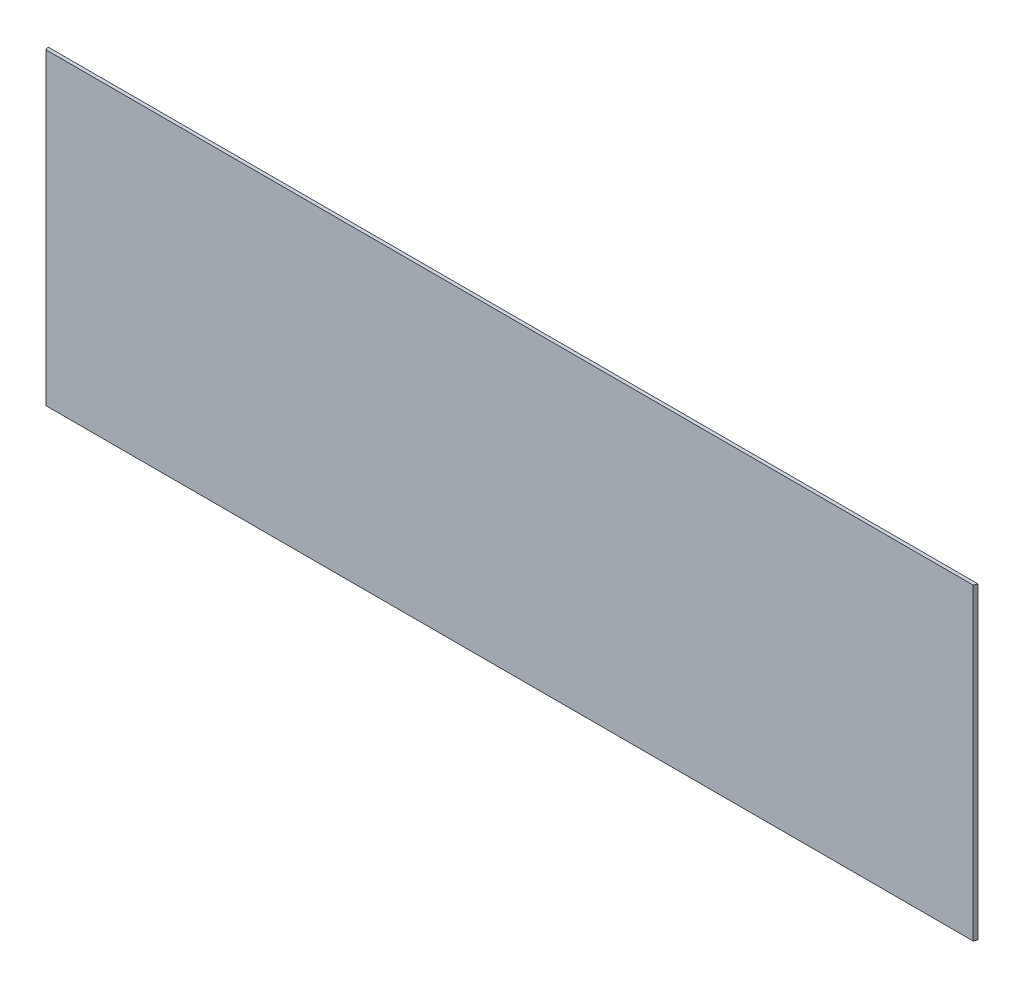
ISO-10303-21;
HEADER;
FILE_DESCRIPTION(('STEP AP214'),'2;1');
FILE_NAME('part.step','',(''),(''),'','','');
FILE_SCHEMA(('AUTOMOTIVE_DESIGN { 1 0 10303 214 1 1 1 1 }'));
ENDSEC;
DATA;
#1=APPLICATION_CONTEXT('core data for automotive mechanical design processes');
#2=APPLICATION_PROTOCOL_DEFINITION('international standard','automotive_design',2000,#1);
#3=PRODUCT_CONTEXT('',#1,'mechanical');
#4=PRODUCT('Part','Part','',(#3));
#5=PRODUCT_RELATED_PRODUCT_CATEGORY('part','',(#4));
#6=PRODUCT_DEFINITION_FORMATION('','',#4);
#7=PRODUCT_DEFINITION_CONTEXT('part definition',#1,'design');
#8=PRODUCT_DEFINITION('design','',#6,#7);
#9=PRODUCT_DEFINITION_SHAPE('','',#8);
#10=(LENGTH_UNIT() NAMED_UNIT(*) SI_UNIT(.MILLI.,.METRE.));
#11=(NAMED_UNIT(*) PLANE_ANGLE_UNIT() SI_UNIT($,.RADIAN.));
#12=(NAMED_UNIT(*) SI_UNIT($,.STERADIAN.) SOLID_ANGLE_UNIT());
#13=UNCERTAINTY_MEASURE_WITH_UNIT(LENGTH_MEASURE(1.E-05),#10,'distance_accuracy_value','');
#14=(GEOMETRIC_REPRESENTATION_CONTEXT(3) GLOBAL_UNCERTAINTY_ASSIGNED_CONTEXT((#13)) GLOBAL_UNIT_ASSIGNED_CONTEXT((#10,
#11,#12)) REPRESENTATION_CONTEXT('',''));
#15=CARTESIAN_POINT('',(0.,0.,0.));
#16=DIRECTION('',(0.,0.,1.));
#17=DIRECTION('',(1.,0.,0.));
#18=AXIS2_PLACEMENT_3D('',#15,#16,#17);
#19=CARTESIAN_POINT('',(-431.038,142.875,-1.58750000000003));
#20=DIRECTION('',(0.923879532511753,0.,-0.382683432363964));
#21=DIRECTION('',(-0.382683432363964,0.,-0.923879532511753));
#22=AXIS2_PLACEMENT_3D('',#19,#20,#21);
#23=PLANE('',#22);
#24=DIRECTION('',(0.382683432363964,0.,0.923879532511753));
#25=VECTOR('',#24,1.);
#26=CARTESIAN_POINT('',(-431.038,-142.875,-1.58750000000003));
#27=LINE('',#26,#25);
#28=CARTESIAN_POINT('',(-431.038,-142.875,-1.58750000000003));
#29=VERTEX_POINT('',#28);
#30=CARTESIAN_POINT('',(-429.72287193947,-142.875,1.58749999999992));
#31=VERTEX_POINT('',#30);
#32=EDGE_CURVE('E95',#29,#31,#27,.T.);
#33=ORIENTED_EDGE('',*,*,#32,.T.);
#34=DIRECTION('',(0.,-1.,0.));
#35=VECTOR('',#34,1.);
#36=CARTESIAN_POINT('',(-429.72287193947,142.875,1.58749999999992));
#37=LINE('',#36,#35);
#38=CARTESIAN_POINT('',(-429.72287193947,142.875,1.58749999999992));
#39=VERTEX_POINT('',#38);
#40=EDGE_CURVE('E11',#39,#31,#37,.T.);
#41=ORIENTED_EDGE('',*,*,#40,.F.);
#42=DIRECTION('',(0.382683432363964,0.,0.923879532511753));
#43=VECTOR('',#42,1.);
#44=CARTESIAN_POINT('',(-431.038,142.875,-1.58750000000003));
#45=LINE('',#44,#43);
#46=CARTESIAN_POINT('',(-431.038,142.875,-1.58750000000003));
#47=VERTEX_POINT('',#46);
#48=EDGE_CURVE('E83',#47,#39,#45,.T.);
#49=ORIENTED_EDGE('',*,*,#48,.F.);
#50=DIRECTION('',(0.,-1.,0.));
#51=VECTOR('',#50,1.);
#52=CARTESIAN_POINT('',(-431.038,142.875,-1.58750000000003));
#53=LINE('',#52,#51);
#54=EDGE_CURVE('E91',#47,#29,#53,.T.);
#55=ORIENTED_EDGE('',*,*,#54,.T.);
#56=EDGE_LOOP('',(#33,#41,#49,#55));
#57=FACE_BOUND('',#56,.T.);
#58=ADVANCED_FACE('F32',(#57),#23,.F.);
#59=CARTESIAN_POINT('',(-429.72287193947,142.875,1.58749999999992));
#60=DIRECTION('',(0.,0.,-1.));
#61=DIRECTION('',(-1.,0.,0.));
#62=AXIS2_PLACEMENT_3D('',#59,#60,#61);
#63=PLANE('',#62);
#64=DIRECTION('',(1.,0.,0.));
#65=VECTOR('',#64,1.);
#66=CARTESIAN_POINT('',(-429.72287193947,-142.875,1.58749999999992));
#67=LINE('',#66,#65);
#68=CARTESIAN_POINT('',(429.722871939465,-142.875,1.58749999999992));
#69=VERTEX_POINT('',#68);
#70=EDGE_CURVE('E87',#31,#69,#67,.T.);
#71=ORIENTED_EDGE('',*,*,#70,.T.);
#72=DIRECTION('',(0.,-1.,0.));
#73=VECTOR('',#72,1.);
#74=CARTESIAN_POINT('',(429.722871939465,142.875,1.58749999999992));
#75=LINE('',#74,#73);
#76=CARTESIAN_POINT('',(429.722871939465,142.875,1.58749999999992));
#77=VERTEX_POINT('',#76);
#78=EDGE_CURVE('E40',#77,#69,#75,.T.);
#79=ORIENTED_EDGE('',*,*,#78,.F.);
#80=DIRECTION('',(1.,0.,0.));
#81=VECTOR('',#80,1.);
#82=CARTESIAN_POINT('',(-429.72287193947,142.875,1.58749999999992));
#83=LINE('',#82,#81);
#84=EDGE_CURVE('E78',#39,#77,#83,.T.);
#85=ORIENTED_EDGE('',*,*,#84,.F.);
#86=ORIENTED_EDGE('',*,*,#40,.T.);
#87=EDGE_LOOP('',(#71,#79,#85,#86));
#88=FACE_BOUND('',#87,.T.);
#89=ADVANCED_FACE('F86',(#88),#63,.F.);
#90=CARTESIAN_POINT('',(431.038,142.875,-1.58750000000003));
#91=DIRECTION('',(-0.923879532511285,0.,-0.382683432365095));
#92=DIRECTION('',(-0.382683432365095,0.,0.923879532511285));
#93=AXIS2_PLACEMENT_3D('',#90,#91,#92);
#94=PLANE('',#93);
#95=DIRECTION('',(0.382683432365095,0.,-0.923879532511285));
#96=VECTOR('',#95,1.);
#97=CARTESIAN_POINT('',(431.038,-142.875,-1.58750000000003));
#98=LINE('',#97,#96);
#99=CARTESIAN_POINT('',(431.038,-142.875,-1.58750000000003));
#100=VERTEX_POINT('',#99);
#101=EDGE_CURVE('E65',#69,#100,#98,.T.);
#102=ORIENTED_EDGE('',*,*,#101,.T.);
#103=DIRECTION('',(0.,-1.,0.));
#104=VECTOR('',#103,1.);
#105=CARTESIAN_POINT('',(431.038,142.875,-1.58750000000003));
#106=LINE('',#105,#104);
#107=CARTESIAN_POINT('',(431.038,142.875,-1.58750000000003));
#108=VERTEX_POINT('',#107);
#109=EDGE_CURVE('E88',#108,#100,#106,.T.);
#110=ORIENTED_EDGE('',*,*,#109,.F.);
#111=DIRECTION('',(0.382683432365095,0.,-0.923879532511285));
#112=VECTOR('',#111,1.);
#113=CARTESIAN_POINT('',(431.038,142.875,-1.58750000000003));
#114=LINE('',#113,#112);
#115=EDGE_CURVE('E81',#77,#108,#114,.T.);
#116=ORIENTED_EDGE('',*,*,#115,.F.);
#117=ORIENTED_EDGE('',*,*,#78,.T.);
#118=EDGE_LOOP('',(#102,#110,#116,#117));
#119=FACE_BOUND('',#118,.T.);
#120=ADVANCED_FACE('F89',(#119),#94,.F.);
#121=CARTESIAN_POINT('',(-431.038,142.875,-1.58750000000003));
#122=DIRECTION('',(0.,0.,1.));
#123=DIRECTION('',(1.,0.,0.));
#124=AXIS2_PLACEMENT_3D('',#121,#122,#123);
#125=PLANE('',#124);
#126=DIRECTION('',(-1.,0.,0.));
#127=VECTOR('',#126,1.);
#128=CARTESIAN_POINT('',(-431.038,-142.875,-1.58750000000003));
#129=LINE('',#128,#127);
#130=EDGE_CURVE('E71',#100,#29,#129,.T.);
#131=ORIENTED_EDGE('',*,*,#130,.T.);
#132=ORIENTED_EDGE('',*,*,#54,.F.);
#133=DIRECTION('',(-1.,0.,0.));
#134=VECTOR('',#133,1.);
#135=CARTESIAN_POINT('',(-431.038,142.875,-1.58750000000003));
#136=LINE('',#135,#134);
#137=EDGE_CURVE('E48',#108,#47,#136,.T.);
#138=ORIENTED_EDGE('',*,*,#137,.F.);
#139=ORIENTED_EDGE('',*,*,#109,.T.);
#140=EDGE_LOOP('',(#131,#132,#138,#139));
#141=FACE_BOUND('',#140,.T.);
#142=ADVANCED_FACE('F102',(#141),#125,.F.);
#143=CARTESIAN_POINT('',(-429.72287193947,142.875,1.58749999999992));
#144=DIRECTION('',(0.,1.,0.));
#145=DIRECTION('',(0.,0.,1.));
#146=AXIS2_PLACEMENT_3D('',#143,#144,#145);
#147=PLANE('',#146);
#148=ORIENTED_EDGE('',*,*,#48,.T.);
#149=ORIENTED_EDGE('',*,*,#84,.T.);
#150=ORIENTED_EDGE('',*,*,#115,.T.);
#151=ORIENTED_EDGE('',*,*,#137,.T.);
#152=EDGE_LOOP('',(#148,#149,#150,#151));
#153=FACE_BOUND('',#152,.T.);
#154=ADVANCED_FACE('F79',(#153),#147,.T.);
#155=CARTESIAN_POINT('',(-429.72287193947,-142.875,1.58749999999992));
#156=DIRECTION('',(0.,1.,0.));
#157=DIRECTION('',(0.,0.,1.));
#158=AXIS2_PLACEMENT_3D('',#155,#156,#157);
#159=PLANE('',#158);
#160=ORIENTED_EDGE('',*,*,#32,.F.);
#161=ORIENTED_EDGE('',*,*,#130,.F.);
#162=ORIENTED_EDGE('',*,*,#101,.F.);
#163=ORIENTED_EDGE('',*,*,#70,.F.);
#164=EDGE_LOOP('',(#160,#161,#162,#163));
#165=FACE_BOUND('',#164,.T.);
#166=ADVANCED_FACE('F105',(#165),#159,.F.);
#167=CLOSED_SHELL('',(#58,#89,#120,#142,#154,#166));
#168=MANIFOLD_SOLID_BREP('B2',#167);
#169=ADVANCED_BREP_SHAPE_REPRESENTATION('',(#18,#168),#14);
#170=SHAPE_DEFINITION_REPRESENTATION(#9,#169);
ENDSEC;
END-ISO-10303-21;
